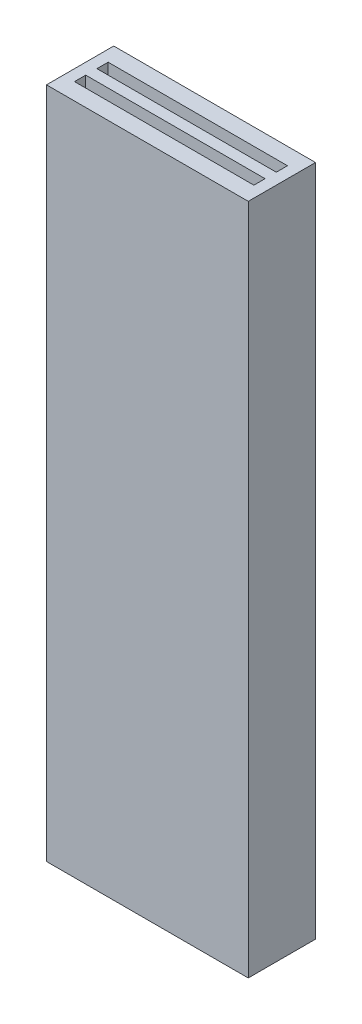
ISO-10303-21;
HEADER;
FILE_DESCRIPTION(('STEP AP214'),'2;1');
FILE_NAME('part.step','',(''),(''),'','','');
FILE_SCHEMA(('AUTOMOTIVE_DESIGN { 1 0 10303 214 1 1 1 1 }'));
ENDSEC;
DATA;
#1=APPLICATION_CONTEXT('core data for automotive mechanical design processes');
#2=APPLICATION_PROTOCOL_DEFINITION('international standard','automotive_design',2000,#1);
#3=PRODUCT_CONTEXT('',#1,'mechanical');
#4=PRODUCT('Part','Part','',(#3));
#5=PRODUCT_RELATED_PRODUCT_CATEGORY('part','',(#4));
#6=PRODUCT_DEFINITION_FORMATION('','',#4);
#7=PRODUCT_DEFINITION_CONTEXT('part definition',#1,'design');
#8=PRODUCT_DEFINITION('design','',#6,#7);
#9=PRODUCT_DEFINITION_SHAPE('','',#8);
#10=(LENGTH_UNIT() NAMED_UNIT(*) SI_UNIT(.MILLI.,.METRE.));
#11=(NAMED_UNIT(*) PLANE_ANGLE_UNIT() SI_UNIT($,.RADIAN.));
#12=(NAMED_UNIT(*) SI_UNIT($,.STERADIAN.) SOLID_ANGLE_UNIT());
#13=UNCERTAINTY_MEASURE_WITH_UNIT(LENGTH_MEASURE(1.E-05),#10,'distance_accuracy_value','');
#14=(GEOMETRIC_REPRESENTATION_CONTEXT(3) GLOBAL_UNCERTAINTY_ASSIGNED_CONTEXT((#13)) GLOBAL_UNIT_ASSIGNED_CONTEXT((#10,
#11,#12)) REPRESENTATION_CONTEXT('',''));
#15=CARTESIAN_POINT('',(0.,0.,0.));
#16=DIRECTION('',(0.,0.,1.));
#17=DIRECTION('',(1.,0.,0.));
#18=AXIS2_PLACEMENT_3D('',#15,#16,#17);
#19=CARTESIAN_POINT('',(0.,15.,0.));
#20=DIRECTION('',(0.,-1.,0.));
#21=DIRECTION('',(0.,0.,-1.));
#22=AXIS2_PLACEMENT_3D('',#19,#20,#21);
#23=PLANE('',#22);
#24=DIRECTION('',(0.,0.,-1.));
#25=VECTOR('',#24,1.);
#26=CARTESIAN_POINT('',(4.5,15.,1.5));
#27=LINE('',#26,#25);
#28=CARTESIAN_POINT('',(4.5,15.,1.5));
#29=VERTEX_POINT('',#28);
#30=CARTESIAN_POINT('',(4.5,15.,-1.5));
#31=VERTEX_POINT('',#30);
#32=EDGE_CURVE('E222',#29,#31,#27,.T.);
#33=ORIENTED_EDGE('',*,*,#32,.T.);
#34=DIRECTION('',(-1.,0.,0.));
#35=VECTOR('',#34,1.);
#36=CARTESIAN_POINT('',(-4.5,15.,-1.5));
#37=LINE('',#36,#35);
#38=CARTESIAN_POINT('',(-4.5,15.,-1.5));
#39=VERTEX_POINT('',#38);
#40=EDGE_CURVE('E226',#31,#39,#37,.T.);
#41=ORIENTED_EDGE('',*,*,#40,.T.);
#42=DIRECTION('',(0.,0.,1.));
#43=VECTOR('',#42,1.);
#44=CARTESIAN_POINT('',(-4.5,15.,1.5));
#45=LINE('',#44,#43);
#46=CARTESIAN_POINT('',(-4.5,15.,1.5));
#47=VERTEX_POINT('',#46);
#48=EDGE_CURVE('E230',#39,#47,#45,.T.);
#49=ORIENTED_EDGE('',*,*,#48,.T.);
#50=DIRECTION('',(1.,0.,0.));
#51=VECTOR('',#50,1.);
#52=CARTESIAN_POINT('',(-4.5,15.,1.5));
#53=LINE('',#52,#51);
#54=EDGE_CURVE('E233',#47,#29,#53,.T.);
#55=ORIENTED_EDGE('',*,*,#54,.T.);
#56=EDGE_LOOP('',(#33,#41,#49,#55));
#57=FACE_BOUND('',#56,.T.);
#58=DIRECTION('',(1.,0.,0.));
#59=VECTOR('',#58,1.);
#60=CARTESIAN_POINT('',(0.,15.,-0.75));
#61=LINE('',#60,#59);
#62=CARTESIAN_POINT('',(-4.,15.,-0.75));
#63=VERTEX_POINT('',#62);
#64=CARTESIAN_POINT('',(4.,15.,-0.75));
#65=VERTEX_POINT('',#64);
#66=EDGE_CURVE('E195',#63,#65,#61,.T.);
#67=ORIENTED_EDGE('',*,*,#66,.T.);
#68=DIRECTION('',(0.,0.,1.));
#69=VECTOR('',#68,1.);
#70=CARTESIAN_POINT('',(4.,15.,0.));
#71=LINE('',#70,#69);
#72=CARTESIAN_POINT('',(4.,15.,-0.25));
#73=VERTEX_POINT('',#72);
#74=EDGE_CURVE('E217',#65,#73,#71,.T.);
#75=ORIENTED_EDGE('',*,*,#74,.T.);
#76=DIRECTION('',(-1.,0.,0.));
#77=VECTOR('',#76,1.);
#78=CARTESIAN_POINT('',(0.,15.,-0.25));
#79=LINE('',#78,#77);
#80=CARTESIAN_POINT('',(-4.,15.,-0.25));
#81=VERTEX_POINT('',#80);
#82=EDGE_CURVE('E213',#73,#81,#79,.T.);
#83=ORIENTED_EDGE('',*,*,#82,.T.);
#84=DIRECTION('',(0.,0.,-1.));
#85=VECTOR('',#84,1.);
#86=CARTESIAN_POINT('',(-4.,15.,0.));
#87=LINE('',#86,#85);
#88=EDGE_CURVE('E209',#81,#63,#87,.T.);
#89=ORIENTED_EDGE('',*,*,#88,.T.);
#90=EDGE_LOOP('',(#67,#75,#83,#89));
#91=FACE_BOUND('',#90,.T.);
#92=DIRECTION('',(0.,0.,-1.));
#93=VECTOR('',#92,1.);
#94=CARTESIAN_POINT('',(4.,15.,0.));
#95=LINE('',#94,#93);
#96=CARTESIAN_POINT('',(4.,15.,0.75));
#97=VERTEX_POINT('',#96);
#98=CARTESIAN_POINT('',(4.,15.,0.25));
#99=VERTEX_POINT('',#98);
#100=EDGE_CURVE('E140',#97,#99,#95,.T.);
#101=ORIENTED_EDGE('',*,*,#100,.F.);
#102=DIRECTION('',(1.,0.,0.));
#103=VECTOR('',#102,1.);
#104=CARTESIAN_POINT('',(0.,15.,0.75));
#105=LINE('',#104,#103);
#106=CARTESIAN_POINT('',(-4.,15.,0.75));
#107=VERTEX_POINT('',#106);
#108=EDGE_CURVE('E169',#107,#97,#105,.T.);
#109=ORIENTED_EDGE('',*,*,#108,.F.);
#110=DIRECTION('',(0.,0.,1.));
#111=VECTOR('',#110,1.);
#112=CARTESIAN_POINT('',(-4.,15.,0.));
#113=LINE('',#112,#111);
#114=CARTESIAN_POINT('',(-4.,15.,0.25));
#115=VERTEX_POINT('',#114);
#116=EDGE_CURVE('E166',#115,#107,#113,.T.);
#117=ORIENTED_EDGE('',*,*,#116,.F.);
#118=DIRECTION('',(-1.,0.,0.));
#119=VECTOR('',#118,1.);
#120=CARTESIAN_POINT('',(0.,15.,0.25));
#121=LINE('',#120,#119);
#122=EDGE_CURVE('E157',#99,#115,#121,.T.);
#123=ORIENTED_EDGE('',*,*,#122,.F.);
#124=EDGE_LOOP('',(#101,#109,#117,#123));
#125=FACE_BOUND('',#124,.T.);
#126=ADVANCED_FACE('F39',(#57,#91,#125),#23,.F.);
#127=CARTESIAN_POINT('',(0.,-15.,0.));
#128=DIRECTION('',(0.,-1.,0.));
#129=DIRECTION('',(0.,0.,-1.));
#130=AXIS2_PLACEMENT_3D('',#127,#128,#129);
#131=PLANE('',#130);
#132=DIRECTION('',(0.,0.,-1.));
#133=VECTOR('',#132,1.);
#134=CARTESIAN_POINT('',(4.,-15.,-0.25));
#135=LINE('',#134,#133);
#136=CARTESIAN_POINT('',(4.,-15.,-0.25));
#137=VERTEX_POINT('',#136);
#138=CARTESIAN_POINT('',(4.,-15.,-0.75));
#139=VERTEX_POINT('',#138);
#140=EDGE_CURVE('E174',#137,#139,#135,.T.);
#141=ORIENTED_EDGE('',*,*,#140,.T.);
#142=DIRECTION('',(-1.,0.,0.));
#143=VECTOR('',#142,1.);
#144=CARTESIAN_POINT('',(-4.,-15.,-0.75));
#145=LINE('',#144,#143);
#146=CARTESIAN_POINT('',(-4.,-15.,-0.75));
#147=VERTEX_POINT('',#146);
#148=EDGE_CURVE('E178',#139,#147,#145,.T.);
#149=ORIENTED_EDGE('',*,*,#148,.T.);
#150=DIRECTION('',(0.,0.,1.));
#151=VECTOR('',#150,1.);
#152=CARTESIAN_POINT('',(-4.,-15.,-0.25));
#153=LINE('',#152,#151);
#154=CARTESIAN_POINT('',(-4.,-15.,-0.25));
#155=VERTEX_POINT('',#154);
#156=EDGE_CURVE('E182',#147,#155,#153,.T.);
#157=ORIENTED_EDGE('',*,*,#156,.T.);
#158=DIRECTION('',(1.,0.,0.));
#159=VECTOR('',#158,1.);
#160=CARTESIAN_POINT('',(-4.,-15.,-0.25));
#161=LINE('',#160,#159);
#162=EDGE_CURVE('E186',#155,#137,#161,.T.);
#163=ORIENTED_EDGE('',*,*,#162,.T.);
#164=EDGE_LOOP('',(#141,#149,#157,#163));
#165=FACE_BOUND('',#164,.T.);
#166=DIRECTION('',(0.,0.,-1.));
#167=VECTOR('',#166,1.);
#168=CARTESIAN_POINT('',(4.5,-15.,1.5));
#169=LINE('',#168,#167);
#170=CARTESIAN_POINT('',(4.5,-15.,1.5));
#171=VERTEX_POINT('',#170);
#172=CARTESIAN_POINT('',(4.5,-15.,-1.5));
#173=VERTEX_POINT('',#172);
#174=EDGE_CURVE('E221',#171,#173,#169,.T.);
#175=ORIENTED_EDGE('',*,*,#174,.F.);
#176=DIRECTION('',(1.,0.,0.));
#177=VECTOR('',#176,1.);
#178=CARTESIAN_POINT('',(-4.5,-15.,1.5));
#179=LINE('',#178,#177);
#180=CARTESIAN_POINT('',(-4.5,-15.,1.5));
#181=VERTEX_POINT('',#180);
#182=EDGE_CURVE('E227',#181,#171,#179,.T.);
#183=ORIENTED_EDGE('',*,*,#182,.F.);
#184=DIRECTION('',(0.,0.,1.));
#185=VECTOR('',#184,1.);
#186=CARTESIAN_POINT('',(-4.5,-15.,1.5));
#187=LINE('',#186,#185);
#188=CARTESIAN_POINT('',(-4.5,-15.,-1.5));
#189=VERTEX_POINT('',#188);
#190=EDGE_CURVE('E243',#189,#181,#187,.T.);
#191=ORIENTED_EDGE('',*,*,#190,.F.);
#192=DIRECTION('',(-1.,0.,0.));
#193=VECTOR('',#192,1.);
#194=CARTESIAN_POINT('',(-4.5,-15.,-1.5));
#195=LINE('',#194,#193);
#196=EDGE_CURVE('E240',#173,#189,#195,.T.);
#197=ORIENTED_EDGE('',*,*,#196,.F.);
#198=EDGE_LOOP('',(#175,#183,#191,#197));
#199=FACE_BOUND('',#198,.T.);
#200=DIRECTION('',(-1.,0.,0.));
#201=VECTOR('',#200,1.);
#202=CARTESIAN_POINT('',(-4.,-15.,0.75));
#203=LINE('',#202,#201);
#204=CARTESIAN_POINT('',(4.,-15.,0.75));
#205=VERTEX_POINT('',#204);
#206=CARTESIAN_POINT('',(-4.,-15.,0.75));
#207=VERTEX_POINT('',#206);
#208=EDGE_CURVE('E143',#205,#207,#203,.T.);
#209=ORIENTED_EDGE('',*,*,#208,.F.);
#210=DIRECTION('',(0.,0.,1.));
#211=VECTOR('',#210,1.);
#212=CARTESIAN_POINT('',(4.,-15.,0.25));
#213=LINE('',#212,#211);
#214=CARTESIAN_POINT('',(4.,-15.,0.25));
#215=VERTEX_POINT('',#214);
#216=EDGE_CURVE('E133',#215,#205,#213,.T.);
#217=ORIENTED_EDGE('',*,*,#216,.F.);
#218=DIRECTION('',(1.,0.,0.));
#219=VECTOR('',#218,1.);
#220=CARTESIAN_POINT('',(-4.,-15.,0.25));
#221=LINE('',#220,#219);
#222=CARTESIAN_POINT('',(-4.,-15.,0.25));
#223=VERTEX_POINT('',#222);
#224=EDGE_CURVE('E126',#223,#215,#221,.T.);
#225=ORIENTED_EDGE('',*,*,#224,.F.);
#226=DIRECTION('',(0.,0.,-1.));
#227=VECTOR('',#226,1.);
#228=CARTESIAN_POINT('',(-4.,-15.,0.25));
#229=LINE('',#228,#227);
#230=EDGE_CURVE('E132',#207,#223,#229,.T.);
#231=ORIENTED_EDGE('',*,*,#230,.F.);
#232=EDGE_LOOP('',(#209,#217,#225,#231));
#233=FACE_BOUND('',#232,.T.);
#234=ADVANCED_FACE('F146',(#165,#199,#233),#131,.T.);
#235=CARTESIAN_POINT('',(4.5,15.,1.5));
#236=DIRECTION('',(-1.,0.,0.));
#237=DIRECTION('',(0.,0.,1.));
#238=AXIS2_PLACEMENT_3D('',#235,#236,#237);
#239=PLANE('',#238);
#240=ORIENTED_EDGE('',*,*,#174,.T.);
#241=DIRECTION('',(0.,-1.,0.));
#242=VECTOR('',#241,1.);
#243=CARTESIAN_POINT('',(4.5,15.,-1.5));
#244=LINE('',#243,#242);
#245=EDGE_CURVE('E11',#31,#173,#244,.T.);
#246=ORIENTED_EDGE('',*,*,#245,.F.);
#247=ORIENTED_EDGE('',*,*,#32,.F.);
#248=DIRECTION('',(0.,-1.,0.));
#249=VECTOR('',#248,1.);
#250=CARTESIAN_POINT('',(4.5,15.,1.5));
#251=LINE('',#250,#249);
#252=EDGE_CURVE('E236',#29,#171,#251,.T.);
#253=ORIENTED_EDGE('',*,*,#252,.T.);
#254=EDGE_LOOP('',(#240,#246,#247,#253));
#255=FACE_BOUND('',#254,.T.);
#256=ADVANCED_FACE('F41',(#255),#239,.F.);
#257=CARTESIAN_POINT('',(-4.5,15.,-1.5));
#258=DIRECTION('',(0.,0.,1.));
#259=DIRECTION('',(1.,0.,0.));
#260=AXIS2_PLACEMENT_3D('',#257,#258,#259);
#261=PLANE('',#260);
#262=ORIENTED_EDGE('',*,*,#196,.T.);
#263=DIRECTION('',(0.,-1.,0.));
#264=VECTOR('',#263,1.);
#265=CARTESIAN_POINT('',(-4.5,15.,-1.5));
#266=LINE('',#265,#264);
#267=EDGE_CURVE('E48',#39,#189,#266,.T.);
#268=ORIENTED_EDGE('',*,*,#267,.F.);
#269=ORIENTED_EDGE('',*,*,#40,.F.);
#270=ORIENTED_EDGE('',*,*,#245,.T.);
#271=EDGE_LOOP('',(#262,#268,#269,#270));
#272=FACE_BOUND('',#271,.T.);
#273=ADVANCED_FACE('F275',(#272),#261,.F.);
#274=CARTESIAN_POINT('',(-4.5,15.,1.5));
#275=DIRECTION('',(1.,0.,0.));
#276=DIRECTION('',(0.,0.,-1.));
#277=AXIS2_PLACEMENT_3D('',#274,#275,#276);
#278=PLANE('',#277);
#279=ORIENTED_EDGE('',*,*,#190,.T.);
#280=DIRECTION('',(0.,-1.,0.));
#281=VECTOR('',#280,1.);
#282=CARTESIAN_POINT('',(-4.5,15.,1.5));
#283=LINE('',#282,#281);
#284=EDGE_CURVE('E251',#47,#181,#283,.T.);
#285=ORIENTED_EDGE('',*,*,#284,.F.);
#286=ORIENTED_EDGE('',*,*,#48,.F.);
#287=ORIENTED_EDGE('',*,*,#267,.T.);
#288=EDGE_LOOP('',(#279,#285,#286,#287));
#289=FACE_BOUND('',#288,.T.);
#290=ADVANCED_FACE('F260',(#289),#278,.F.);
#291=CARTESIAN_POINT('',(-4.5,15.,1.5));
#292=DIRECTION('',(0.,0.,-1.));
#293=DIRECTION('',(-1.,0.,0.));
#294=AXIS2_PLACEMENT_3D('',#291,#292,#293);
#295=PLANE('',#294);
#296=ORIENTED_EDGE('',*,*,#182,.T.);
#297=ORIENTED_EDGE('',*,*,#252,.F.);
#298=ORIENTED_EDGE('',*,*,#54,.F.);
#299=ORIENTED_EDGE('',*,*,#284,.T.);
#300=EDGE_LOOP('',(#296,#297,#298,#299));
#301=FACE_BOUND('',#300,.T.);
#302=ADVANCED_FACE('F268',(#301),#295,.F.);
#303=CARTESIAN_POINT('',(4.,-15.,-0.25));
#304=DIRECTION('',(1.,0.,0.));
#305=DIRECTION('',(0.,0.,-1.));
#306=AXIS2_PLACEMENT_3D('',#303,#304,#305);
#307=PLANE('',#306);
#308=DIRECTION('',(0.,1.,0.));
#309=VECTOR('',#308,1.);
#310=CARTESIAN_POINT('',(4.,-15.,-0.75));
#311=LINE('',#310,#309);
#312=EDGE_CURVE('E190',#139,#65,#311,.T.);
#313=ORIENTED_EDGE('',*,*,#312,.F.);
#314=ORIENTED_EDGE('',*,*,#140,.F.);
#315=DIRECTION('',(0.,1.,0.));
#316=VECTOR('',#315,1.);
#317=CARTESIAN_POINT('',(4.,-15.,-0.25));
#318=LINE('',#317,#316);
#319=EDGE_CURVE('E191',#137,#73,#318,.T.);
#320=ORIENTED_EDGE('',*,*,#319,.T.);
#321=ORIENTED_EDGE('',*,*,#74,.F.);
#322=EDGE_LOOP('',(#313,#314,#320,#321));
#323=FACE_BOUND('',#322,.T.);
#324=ADVANCED_FACE('F290',(#323),#307,.F.);
#325=CARTESIAN_POINT('',(-4.,-15.,-0.25));
#326=DIRECTION('',(0.,0.,1.));
#327=DIRECTION('',(1.,0.,0.));
#328=AXIS2_PLACEMENT_3D('',#325,#326,#327);
#329=PLANE('',#328);
#330=ORIENTED_EDGE('',*,*,#319,.F.);
#331=ORIENTED_EDGE('',*,*,#162,.F.);
#332=DIRECTION('',(0.,1.,0.));
#333=VECTOR('',#332,1.);
#334=CARTESIAN_POINT('',(-4.,-15.,-0.25));
#335=LINE('',#334,#333);
#336=EDGE_CURVE('E196',#155,#81,#335,.T.);
#337=ORIENTED_EDGE('',*,*,#336,.T.);
#338=ORIENTED_EDGE('',*,*,#82,.F.);
#339=EDGE_LOOP('',(#330,#331,#337,#338));
#340=FACE_BOUND('',#339,.T.);
#341=ADVANCED_FACE('F297',(#340),#329,.F.);
#342=CARTESIAN_POINT('',(-4.,-15.,-0.25));
#343=DIRECTION('',(-1.,0.,0.));
#344=DIRECTION('',(0.,0.,1.));
#345=AXIS2_PLACEMENT_3D('',#342,#343,#344);
#346=PLANE('',#345);
#347=ORIENTED_EDGE('',*,*,#336,.F.);
#348=ORIENTED_EDGE('',*,*,#156,.F.);
#349=DIRECTION('',(0.,1.,0.));
#350=VECTOR('',#349,1.);
#351=CARTESIAN_POINT('',(-4.,-15.,-0.75));
#352=LINE('',#351,#350);
#353=EDGE_CURVE('E200',#147,#63,#352,.T.);
#354=ORIENTED_EDGE('',*,*,#353,.T.);
#355=ORIENTED_EDGE('',*,*,#88,.F.);
#356=EDGE_LOOP('',(#347,#348,#354,#355));
#357=FACE_BOUND('',#356,.T.);
#358=ADVANCED_FACE('F302',(#357),#346,.F.);
#359=CARTESIAN_POINT('',(-4.,-15.,-0.75));
#360=DIRECTION('',(0.,0.,-1.));
#361=DIRECTION('',(-1.,0.,0.));
#362=AXIS2_PLACEMENT_3D('',#359,#360,#361);
#363=PLANE('',#362);
#364=ORIENTED_EDGE('',*,*,#353,.F.);
#365=ORIENTED_EDGE('',*,*,#148,.F.);
#366=ORIENTED_EDGE('',*,*,#312,.T.);
#367=ORIENTED_EDGE('',*,*,#66,.F.);
#368=EDGE_LOOP('',(#364,#365,#366,#367));
#369=FACE_BOUND('',#368,.T.);
#370=ADVANCED_FACE('F310',(#369),#363,.F.);
#371=CARTESIAN_POINT('',(4.,-15.,0.25));
#372=DIRECTION('',(-1.,0.,0.));
#373=DIRECTION('',(0.,0.,1.));
#374=AXIS2_PLACEMENT_3D('',#371,#372,#373);
#375=PLANE('',#374);
#376=ORIENTED_EDGE('',*,*,#100,.T.);
#377=DIRECTION('',(0.,1.,0.));
#378=VECTOR('',#377,1.);
#379=CARTESIAN_POINT('',(4.,-15.,0.25));
#380=LINE('',#379,#378);
#381=EDGE_CURVE('E55',#215,#99,#380,.T.);
#382=ORIENTED_EDGE('',*,*,#381,.F.);
#383=ORIENTED_EDGE('',*,*,#216,.T.);
#384=DIRECTION('',(0.,1.,0.));
#385=VECTOR('',#384,1.);
#386=CARTESIAN_POINT('',(4.,-15.,0.75));
#387=LINE('',#386,#385);
#388=EDGE_CURVE('E154',#205,#97,#387,.T.);
#389=ORIENTED_EDGE('',*,*,#388,.T.);
#390=EDGE_LOOP('',(#376,#382,#383,#389));
#391=FACE_BOUND('',#390,.T.);
#392=ADVANCED_FACE('F136',(#391),#375,.T.);
#393=CARTESIAN_POINT('',(-4.,-15.,0.75));
#394=DIRECTION('',(0.,0.,-1.));
#395=DIRECTION('',(-1.,0.,0.));
#396=AXIS2_PLACEMENT_3D('',#393,#394,#395);
#397=PLANE('',#396);
#398=ORIENTED_EDGE('',*,*,#108,.T.);
#399=ORIENTED_EDGE('',*,*,#388,.F.);
#400=ORIENTED_EDGE('',*,*,#208,.T.);
#401=DIRECTION('',(0.,1.,0.));
#402=VECTOR('',#401,1.);
#403=CARTESIAN_POINT('',(-4.,-15.,0.75));
#404=LINE('',#403,#402);
#405=EDGE_CURVE('E158',#207,#107,#404,.T.);
#406=ORIENTED_EDGE('',*,*,#405,.T.);
#407=EDGE_LOOP('',(#398,#399,#400,#406));
#408=FACE_BOUND('',#407,.T.);
#409=ADVANCED_FACE('F322',(#408),#397,.T.);
#410=CARTESIAN_POINT('',(-4.,-15.,0.25));
#411=DIRECTION('',(1.,0.,0.));
#412=DIRECTION('',(0.,0.,-1.));
#413=AXIS2_PLACEMENT_3D('',#410,#411,#412);
#414=PLANE('',#413);
#415=ORIENTED_EDGE('',*,*,#116,.T.);
#416=ORIENTED_EDGE('',*,*,#405,.F.);
#417=ORIENTED_EDGE('',*,*,#230,.T.);
#418=DIRECTION('',(0.,1.,0.));
#419=VECTOR('',#418,1.);
#420=CARTESIAN_POINT('',(-4.,-15.,0.25));
#421=LINE('',#420,#419);
#422=EDGE_CURVE('E60',#223,#115,#421,.T.);
#423=ORIENTED_EDGE('',*,*,#422,.T.);
#424=EDGE_LOOP('',(#415,#416,#417,#423));
#425=FACE_BOUND('',#424,.T.);
#426=ADVANCED_FACE('F325',(#425),#414,.T.);
#427=CARTESIAN_POINT('',(-4.,-15.,0.25));
#428=DIRECTION('',(0.,0.,1.));
#429=DIRECTION('',(1.,0.,0.));
#430=AXIS2_PLACEMENT_3D('',#427,#428,#429);
#431=PLANE('',#430);
#432=ORIENTED_EDGE('',*,*,#122,.T.);
#433=ORIENTED_EDGE('',*,*,#422,.F.);
#434=ORIENTED_EDGE('',*,*,#224,.T.);
#435=ORIENTED_EDGE('',*,*,#381,.T.);
#436=EDGE_LOOP('',(#432,#433,#434,#435));
#437=FACE_BOUND('',#436,.T.);
#438=ADVANCED_FACE('F127',(#437),#431,.T.);
#439=CLOSED_SHELL('',(#126,#234,#256,#273,#290,#302,#324,#341,#358,#370,#392,#409,#426,#438));
#440=MANIFOLD_SOLID_BREP('B2',#439);
#441=ADVANCED_BREP_SHAPE_REPRESENTATION('',(#18,#440),#14);
#442=SHAPE_DEFINITION_REPRESENTATION(#9,#441);
ENDSEC;
END-ISO-10303-21;
